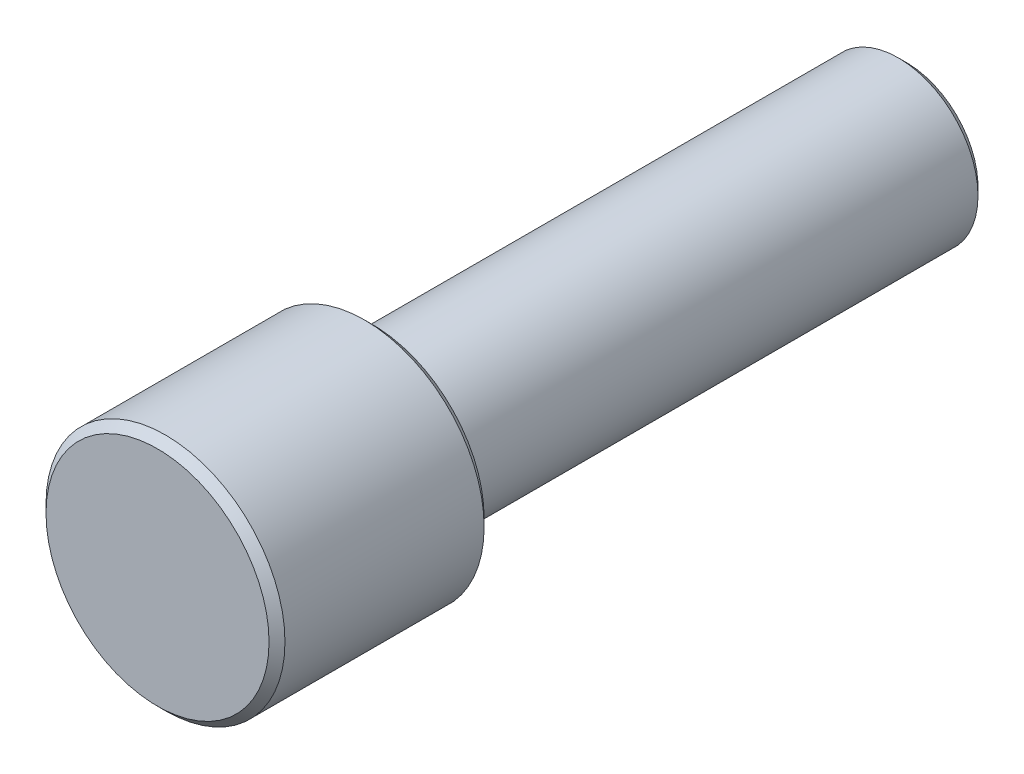
ISO-10303-21;
HEADER;
FILE_DESCRIPTION(('STEP AP214'),'2;1');
FILE_NAME('part.step','',(''),(''),'','','');
FILE_SCHEMA(('AUTOMOTIVE_DESIGN { 1 0 10303 214 1 1 1 1 }'));
ENDSEC;
DATA;
#1=APPLICATION_CONTEXT('core data for automotive mechanical design processes');
#2=APPLICATION_PROTOCOL_DEFINITION('international standard','automotive_design',2000,#1);
#3=PRODUCT_CONTEXT('',#1,'mechanical');
#4=PRODUCT('Part','Part','',(#3));
#5=PRODUCT_RELATED_PRODUCT_CATEGORY('part','',(#4));
#6=PRODUCT_DEFINITION_FORMATION('','',#4);
#7=PRODUCT_DEFINITION_CONTEXT('part definition',#1,'design');
#8=PRODUCT_DEFINITION('design','',#6,#7);
#9=PRODUCT_DEFINITION_SHAPE('','',#8);
#10=(LENGTH_UNIT() NAMED_UNIT(*) SI_UNIT(.MILLI.,.METRE.));
#11=(NAMED_UNIT(*) PLANE_ANGLE_UNIT() SI_UNIT($,.RADIAN.));
#12=(NAMED_UNIT(*) SI_UNIT($,.STERADIAN.) SOLID_ANGLE_UNIT());
#13=UNCERTAINTY_MEASURE_WITH_UNIT(LENGTH_MEASURE(1.E-05),#10,'distance_accuracy_value','');
#14=(GEOMETRIC_REPRESENTATION_CONTEXT(3) GLOBAL_UNCERTAINTY_ASSIGNED_CONTEXT((#13)) GLOBAL_UNIT_ASSIGNED_CONTEXT((#10,
#11,#12)) REPRESENTATION_CONTEXT('',''));
#15=CARTESIAN_POINT('',(0.,0.,0.));
#16=DIRECTION('',(0.,0.,1.));
#17=DIRECTION('',(1.,0.,0.));
#18=AXIS2_PLACEMENT_3D('',#15,#16,#17);
#19=CARTESIAN_POINT('',(0.,0.,0.));
#20=DIRECTION('',(0.,0.,1.));
#21=DIRECTION('',(1.,0.,0.));
#22=AXIS2_PLACEMENT_3D('',#19,#20,#21);
#23=PLANE('',#22);
#24=CARTESIAN_POINT('',(0.,0.,0.));
#25=DIRECTION('',(0.,0.,1.));
#26=DIRECTION('',(1.,0.,0.));
#27=AXIS2_PLACEMENT_3D('',#24,#25,#26);
#28=CIRCLE('',#27,11.5);
#29=CARTESIAN_POINT('',(11.5,0.,0.));
#30=VERTEX_POINT('',#29);
#31=EDGE_CURVE('E10',#30,#30,#28,.T.);
#32=ORIENTED_EDGE('',*,*,#31,.T.);
#33=EDGE_LOOP('',(#32));
#34=FACE_BOUND('',#33,.T.);
#35=CARTESIAN_POINT('',(0.,0.,0.));
#36=DIRECTION('',(0.,0.,1.));
#37=DIRECTION('',(1.,0.,0.));
#38=AXIS2_PLACEMENT_3D('',#35,#36,#37);
#39=CIRCLE('',#38,14.);
#40=CARTESIAN_POINT('',(14.,0.,0.));
#41=VERTEX_POINT('',#40);
#42=EDGE_CURVE('E48',#41,#41,#39,.F.);
#43=ORIENTED_EDGE('',*,*,#42,.T.);
#44=EDGE_LOOP('',(#43));
#45=FACE_BOUND('',#44,.T.);
#46=ADVANCED_FACE('F33',(#34,#45),#23,.F.);
#47=CARTESIAN_POINT('',(0.,0.,27.));
#48=DIRECTION('',(0.,0.,-1.));
#49=DIRECTION('',(-1.,0.,0.));
#50=AXIS2_PLACEMENT_3D('',#47,#48,#49);
#51=CYLINDRICAL_SURFACE('',#50,15.);
#52=CARTESIAN_POINT('',(0.,0.,1.));
#53=DIRECTION('',(0.,0.,1.));
#54=DIRECTION('',(1.,0.,0.));
#55=AXIS2_PLACEMENT_3D('',#52,#53,#54);
#56=CIRCLE('',#55,15.);
#57=CARTESIAN_POINT('',(15.,0.,1.));
#58=VERTEX_POINT('',#57);
#59=EDGE_CURVE('E53',#58,#58,#56,.T.);
#60=ORIENTED_EDGE('',*,*,#59,.T.);
#61=EDGE_LOOP('',(#60));
#62=FACE_BOUND('',#61,.T.);
#63=CARTESIAN_POINT('',(0.,0.,26.));
#64=DIRECTION('',(0.,0.,1.));
#65=DIRECTION('',(1.,0.,0.));
#66=AXIS2_PLACEMENT_3D('',#63,#64,#65);
#67=CIRCLE('',#66,15.);
#68=CARTESIAN_POINT('',(15.,0.,26.));
#69=VERTEX_POINT('',#68);
#70=EDGE_CURVE('E56',#69,#69,#67,.F.);
#71=ORIENTED_EDGE('',*,*,#70,.T.);
#72=EDGE_LOOP('',(#71));
#73=FACE_BOUND('',#72,.T.);
#74=ADVANCED_FACE('F85',(#62,#73),#51,.T.);
#75=CARTESIAN_POINT('',(0.,0.,27.));
#76=DIRECTION('',(0.,0.,1.));
#77=DIRECTION('',(1.,0.,0.));
#78=AXIS2_PLACEMENT_3D('',#75,#76,#77);
#79=PLANE('',#78);
#80=CARTESIAN_POINT('',(0.,0.,27.));
#81=DIRECTION('',(0.,0.,1.));
#82=DIRECTION('',(1.,0.,0.));
#83=AXIS2_PLACEMENT_3D('',#80,#81,#82);
#84=CIRCLE('',#83,14.);
#85=CARTESIAN_POINT('',(14.,0.,27.));
#86=VERTEX_POINT('',#85);
#87=EDGE_CURVE('E44',#86,#86,#84,.T.);
#88=ORIENTED_EDGE('',*,*,#87,.T.);
#89=EDGE_LOOP('',(#88));
#90=FACE_BOUND('',#89,.T.);
#91=ADVANCED_FACE('F90',(#90),#79,.T.);
#92=CARTESIAN_POINT('',(0.,0.,-67.));
#93=DIRECTION('',(0.,0.,1.));
#94=DIRECTION('',(1.,0.,0.));
#95=AXIS2_PLACEMENT_3D('',#92,#93,#94);
#96=CYLINDRICAL_SURFACE('',#95,10.);
#97=CARTESIAN_POINT('',(0.,0.,-1.5));
#98=DIRECTION('',(0.,0.,1.));
#99=DIRECTION('',(1.,0.,0.));
#100=AXIS2_PLACEMENT_3D('',#97,#98,#99);
#101=CIRCLE('',#100,10.);
#102=CARTESIAN_POINT('',(10.,0.,-1.5));
#103=VERTEX_POINT('',#102);
#104=EDGE_CURVE('E40',#103,#103,#101,.F.);
#105=ORIENTED_EDGE('',*,*,#104,.T.);
#106=EDGE_LOOP('',(#105));
#107=FACE_BOUND('',#106,.T.);
#108=CARTESIAN_POINT('',(0.,0.,-66.));
#109=DIRECTION('',(0.,0.,-1.));
#110=DIRECTION('',(-1.,0.,0.));
#111=AXIS2_PLACEMENT_3D('',#108,#109,#110);
#112=CIRCLE('',#111,10.);
#113=CARTESIAN_POINT('',(-10.,0.,-66.));
#114=VERTEX_POINT('',#113);
#115=EDGE_CURVE('E59',#114,#114,#112,.F.);
#116=ORIENTED_EDGE('',*,*,#115,.T.);
#117=EDGE_LOOP('',(#116));
#118=FACE_BOUND('',#117,.T.);
#119=ADVANCED_FACE('F80',(#107,#118),#96,.T.);
#120=CARTESIAN_POINT('',(0.,0.,-67.));
#121=DIRECTION('',(0.,0.,-1.));
#122=DIRECTION('',(-1.,0.,0.));
#123=AXIS2_PLACEMENT_3D('',#120,#121,#122);
#124=PLANE('',#123);
#125=CARTESIAN_POINT('',(0.,0.,-67.));
#126=DIRECTION('',(0.,0.,-1.));
#127=DIRECTION('',(-1.,0.,0.));
#128=AXIS2_PLACEMENT_3D('',#125,#126,#127);
#129=CIRCLE('',#128,8.99999999999998);
#130=CARTESIAN_POINT('',(-8.99999999999998,0.,-67.));
#131=VERTEX_POINT('',#130);
#132=EDGE_CURVE('E62',#131,#131,#129,.T.);
#133=ORIENTED_EDGE('',*,*,#132,.T.);
#134=EDGE_LOOP('',(#133));
#135=FACE_BOUND('',#134,.T.);
#136=ADVANCED_FACE('F66',(#135),#124,.T.);
#137=CARTESIAN_POINT('',(0.,0.,-67.));
#138=DIRECTION('',(0.,0.,1.));
#139=DIRECTION('',(1.,0.,0.));
#140=AXIS2_PLACEMENT_3D('',#137,#138,#139);
#141=CONICAL_SURFACE('',#140,8.99999999999998,0.785398163397451);
#142=ORIENTED_EDGE('',*,*,#115,.F.);
#143=EDGE_LOOP('',(#142));
#144=FACE_BOUND('',#143,.T.);
#145=ORIENTED_EDGE('',*,*,#132,.F.);
#146=EDGE_LOOP('',(#145));
#147=FACE_BOUND('',#146,.T.);
#148=ADVANCED_FACE('F68',(#144,#147),#141,.T.);
#149=CARTESIAN_POINT('',(0.,0.,1.));
#150=DIRECTION('',(0.,0.,1.));
#151=DIRECTION('',(1.,0.,0.));
#152=AXIS2_PLACEMENT_3D('',#149,#150,#151);
#153=CONICAL_SURFACE('',#152,15.,0.785398163397449);
#154=ORIENTED_EDGE('',*,*,#42,.F.);
#155=EDGE_LOOP('',(#154));
#156=FACE_BOUND('',#155,.T.);
#157=ORIENTED_EDGE('',*,*,#59,.F.);
#158=EDGE_LOOP('',(#157));
#159=FACE_BOUND('',#158,.T.);
#160=ADVANCED_FACE('F70',(#156,#159),#153,.T.);
#161=CARTESIAN_POINT('',(0.,0.,27.));
#162=DIRECTION('',(0.,0.,-1.));
#163=DIRECTION('',(-1.,0.,0.));
#164=AXIS2_PLACEMENT_3D('',#161,#162,#163);
#165=CONICAL_SURFACE('',#164,14.,0.785398163397451);
#166=ORIENTED_EDGE('',*,*,#70,.F.);
#167=EDGE_LOOP('',(#166));
#168=FACE_BOUND('',#167,.T.);
#169=ORIENTED_EDGE('',*,*,#87,.F.);
#170=EDGE_LOOP('',(#169));
#171=FACE_BOUND('',#170,.T.);
#172=ADVANCED_FACE('F77',(#168,#171),#165,.T.);
#173=CARTESIAN_POINT('',(0.,0.,-1.5));
#174=DIRECTION('',(0.,0.,1.));
#175=DIRECTION('',(1.,0.,0.));
#176=AXIS2_PLACEMENT_3D('',#173,#174,#175);
#177=TOROIDAL_SURFACE('',#176,11.5,1.5);
#178=ORIENTED_EDGE('',*,*,#31,.F.);
#179=EDGE_LOOP('',(#178));
#180=FACE_BOUND('',#179,.T.);
#181=ORIENTED_EDGE('',*,*,#104,.F.);
#182=EDGE_LOOP('',(#181));
#183=FACE_BOUND('',#182,.T.);
#184=ADVANCED_FACE('F35',(#180,#183),#177,.F.);
#185=CLOSED_SHELL('',(#46,#74,#91,#119,#136,#148,#160,#172,#184));
#186=MANIFOLD_SOLID_BREP('B2',#185);
#187=ADVANCED_BREP_SHAPE_REPRESENTATION('',(#18,#186),#14);
#188=SHAPE_DEFINITION_REPRESENTATION(#9,#187);
ENDSEC;
END-ISO-10303-21;
